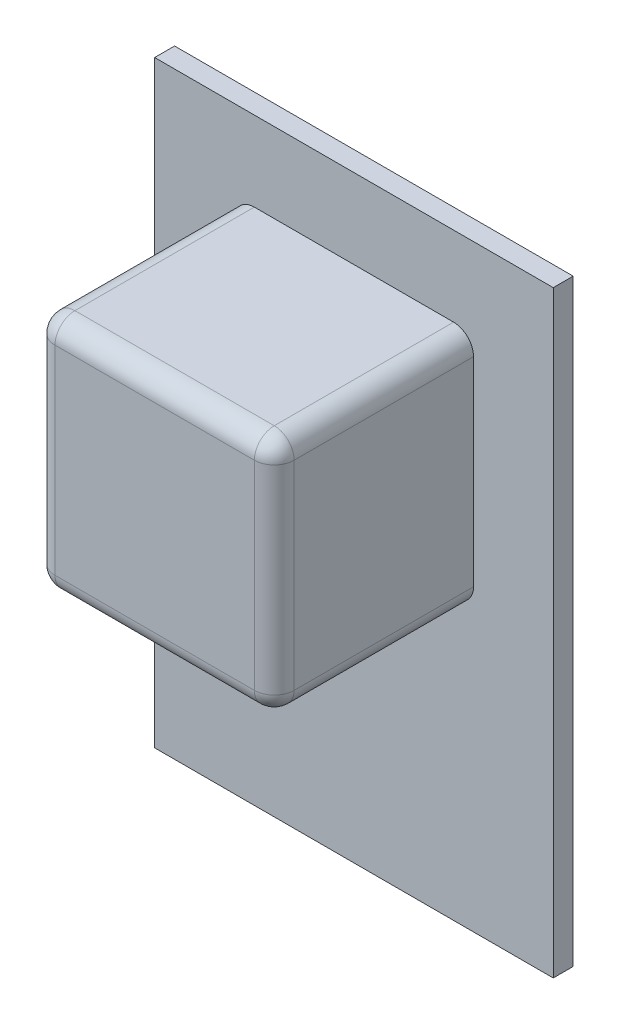
ISO-10303-21;
HEADER;
FILE_DESCRIPTION(('STEP AP214'),'2;1');
FILE_NAME('part.step','',(''),(''),'','','');
FILE_SCHEMA(('AUTOMOTIVE_DESIGN { 1 0 10303 214 1 1 1 1 }'));
ENDSEC;
DATA;
#1=APPLICATION_CONTEXT('core data for automotive mechanical design processes');
#2=APPLICATION_PROTOCOL_DEFINITION('international standard','automotive_design',2000,#1);
#3=PRODUCT_CONTEXT('',#1,'mechanical');
#4=PRODUCT('Part','Part','',(#3));
#5=PRODUCT_RELATED_PRODUCT_CATEGORY('part','',(#4));
#6=PRODUCT_DEFINITION_FORMATION('','',#4);
#7=PRODUCT_DEFINITION_CONTEXT('part definition',#1,'design');
#8=PRODUCT_DEFINITION('design','',#6,#7);
#9=PRODUCT_DEFINITION_SHAPE('','',#8);
#10=(LENGTH_UNIT() NAMED_UNIT(*) SI_UNIT(.MILLI.,.METRE.));
#11=(NAMED_UNIT(*) PLANE_ANGLE_UNIT() SI_UNIT($,.RADIAN.));
#12=(NAMED_UNIT(*) SI_UNIT($,.STERADIAN.) SOLID_ANGLE_UNIT());
#13=UNCERTAINTY_MEASURE_WITH_UNIT(LENGTH_MEASURE(1.E-05),#10,'distance_accuracy_value','');
#14=(GEOMETRIC_REPRESENTATION_CONTEXT(3) GLOBAL_UNCERTAINTY_ASSIGNED_CONTEXT((#13)) GLOBAL_UNIT_ASSIGNED_CONTEXT((#10,
#11,#12)) REPRESENTATION_CONTEXT('',''));
#15=CARTESIAN_POINT('',(0.,0.,0.));
#16=DIRECTION('',(0.,0.,1.));
#17=DIRECTION('',(1.,0.,0.));
#18=AXIS2_PLACEMENT_3D('',#15,#16,#17);
#19=CARTESIAN_POINT('',(0.,0.,0.));
#20=DIRECTION('',(0.,0.,-1.));
#21=DIRECTION('',(-1.,0.,0.));
#22=AXIS2_PLACEMENT_3D('',#19,#20,#21);
#23=PLANE('',#22);
#24=DIRECTION('',(0.,1.,0.));
#25=VECTOR('',#24,1.);
#26=CARTESIAN_POINT('',(100.,-150.,0.));
#27=LINE('',#26,#25);
#28=CARTESIAN_POINT('',(100.,-150.,0.));
#29=VERTEX_POINT('',#28);
#30=CARTESIAN_POINT('',(100.,150.,0.));
#31=VERTEX_POINT('',#30);
#32=EDGE_CURVE('E173',#29,#31,#27,.T.);
#33=ORIENTED_EDGE('',*,*,#32,.T.);
#34=DIRECTION('',(-1.,0.,0.));
#35=VECTOR('',#34,1.);
#36=CARTESIAN_POINT('',(-100.,150.,0.));
#37=LINE('',#36,#35);
#38=CARTESIAN_POINT('',(-100.,150.,0.));
#39=VERTEX_POINT('',#38);
#40=EDGE_CURVE('E142',#31,#39,#37,.T.);
#41=ORIENTED_EDGE('',*,*,#40,.T.);
#42=DIRECTION('',(0.,-1.,0.));
#43=VECTOR('',#42,1.);
#44=CARTESIAN_POINT('',(-100.,-150.,0.));
#45=LINE('',#44,#43);
#46=CARTESIAN_POINT('',(-100.,-150.,0.));
#47=VERTEX_POINT('',#46);
#48=EDGE_CURVE('E165',#39,#47,#45,.T.);
#49=ORIENTED_EDGE('',*,*,#48,.T.);
#50=DIRECTION('',(1.,0.,0.));
#51=VECTOR('',#50,1.);
#52=CARTESIAN_POINT('',(-100.,-150.,0.));
#53=LINE('',#52,#51);
#54=EDGE_CURVE('E162',#47,#29,#53,.T.);
#55=ORIENTED_EDGE('',*,*,#54,.T.);
#56=EDGE_LOOP('',(#33,#41,#49,#55));
#57=FACE_BOUND('',#56,.T.);
#58=DIRECTION('',(0.,1.,0.));
#59=VECTOR('',#58,1.);
#60=CARTESIAN_POINT('',(60.,-10.,0.));
#61=LINE('',#60,#59);
#62=CARTESIAN_POINT('',(60.,0.,0.));
#63=VERTEX_POINT('',#62);
#64=CARTESIAN_POINT('',(60.,100.,0.));
#65=VERTEX_POINT('',#64);
#66=EDGE_CURVE('E252',#63,#65,#61,.T.);
#67=ORIENTED_EDGE('',*,*,#66,.F.);
#68=CARTESIAN_POINT('',(50.,0.,0.));
#69=DIRECTION('',(0.,0.,-1.));
#70=DIRECTION('',(-1.,0.,0.));
#71=AXIS2_PLACEMENT_3D('',#68,#69,#70);
#72=CIRCLE('',#71,10.);
#73=CARTESIAN_POINT('',(50.,-10.,0.));
#74=VERTEX_POINT('',#73);
#75=EDGE_CURVE('E216',#63,#74,#72,.T.);
#76=ORIENTED_EDGE('',*,*,#75,.T.);
#77=DIRECTION('',(1.,0.,0.));
#78=VECTOR('',#77,1.);
#79=CARTESIAN_POINT('',(-60.,-10.,0.));
#80=LINE('',#79,#78);
#81=CARTESIAN_POINT('',(-50.,-10.,0.));
#82=VERTEX_POINT('',#81);
#83=EDGE_CURVE('E168',#82,#74,#80,.T.);
#84=ORIENTED_EDGE('',*,*,#83,.F.);
#85=CARTESIAN_POINT('',(-50.,0.,0.));
#86=DIRECTION('',(0.,0.,-1.));
#87=DIRECTION('',(-1.,0.,0.));
#88=AXIS2_PLACEMENT_3D('',#85,#86,#87);
#89=CIRCLE('',#88,10.);
#90=CARTESIAN_POINT('',(-60.,0.,0.));
#91=VERTEX_POINT('',#90);
#92=EDGE_CURVE('E214',#82,#91,#89,.T.);
#93=ORIENTED_EDGE('',*,*,#92,.T.);
#94=DIRECTION('',(0.,-1.,0.));
#95=VECTOR('',#94,1.);
#96=CARTESIAN_POINT('',(-60.,-10.,0.));
#97=LINE('',#96,#95);
#98=CARTESIAN_POINT('',(-60.,100.,0.));
#99=VERTEX_POINT('',#98);
#100=EDGE_CURVE('E258',#99,#91,#97,.T.);
#101=ORIENTED_EDGE('',*,*,#100,.F.);
#102=CARTESIAN_POINT('',(-50.,100.,0.));
#103=DIRECTION('',(0.,0.,-1.));
#104=DIRECTION('',(-1.,0.,0.));
#105=AXIS2_PLACEMENT_3D('',#102,#103,#104);
#106=CIRCLE('',#105,10.);
#107=CARTESIAN_POINT('',(-50.,110.,0.));
#108=VERTEX_POINT('',#107);
#109=EDGE_CURVE('E11',#99,#108,#106,.T.);
#110=ORIENTED_EDGE('',*,*,#109,.T.);
#111=DIRECTION('',(-1.,0.,0.));
#112=VECTOR('',#111,1.);
#113=CARTESIAN_POINT('',(-60.,110.,0.));
#114=LINE('',#113,#112);
#115=CARTESIAN_POINT('',(50.,110.,0.));
#116=VERTEX_POINT('',#115);
#117=EDGE_CURVE('E254',#116,#108,#114,.T.);
#118=ORIENTED_EDGE('',*,*,#117,.F.);
#119=CARTESIAN_POINT('',(50.,100.,0.));
#120=DIRECTION('',(0.,0.,-1.));
#121=DIRECTION('',(-1.,0.,0.));
#122=AXIS2_PLACEMENT_3D('',#119,#120,#121);
#123=CIRCLE('',#122,10.);
#124=EDGE_CURVE('E44',#116,#65,#123,.T.);
#125=ORIENTED_EDGE('',*,*,#124,.T.);
#126=EDGE_LOOP('',(#67,#76,#84,#93,#101,#110,#118,#125));
#127=FACE_BOUND('',#126,.T.);
#128=ADVANCED_FACE('F35',(#57,#127),#23,.F.);
#129=CARTESIAN_POINT('',(100.,-150.,-10.));
#130=DIRECTION('',(1.,0.,0.));
#131=DIRECTION('',(0.,0.,-1.));
#132=AXIS2_PLACEMENT_3D('',#129,#130,#131);
#133=PLANE('',#132);
#134=ORIENTED_EDGE('',*,*,#32,.F.);
#135=DIRECTION('',(0.,0.,1.));
#136=VECTOR('',#135,1.);
#137=CARTESIAN_POINT('',(100.,-150.,-10.));
#138=LINE('',#137,#136);
#139=CARTESIAN_POINT('',(100.,-150.,-10.));
#140=VERTEX_POINT('',#139);
#141=EDGE_CURVE('E161',#140,#29,#138,.T.);
#142=ORIENTED_EDGE('',*,*,#141,.F.);
#143=DIRECTION('',(0.,1.,0.));
#144=VECTOR('',#143,1.);
#145=CARTESIAN_POINT('',(100.,-150.,-10.));
#146=LINE('',#145,#144);
#147=CARTESIAN_POINT('',(100.,150.,-10.));
#148=VERTEX_POINT('',#147);
#149=EDGE_CURVE('E155',#140,#148,#146,.T.);
#150=ORIENTED_EDGE('',*,*,#149,.T.);
#151=DIRECTION('',(0.,0.,1.));
#152=VECTOR('',#151,1.);
#153=CARTESIAN_POINT('',(100.,150.,-10.));
#154=LINE('',#153,#152);
#155=EDGE_CURVE('E137',#148,#31,#154,.T.);
#156=ORIENTED_EDGE('',*,*,#155,.T.);
#157=EDGE_LOOP('',(#134,#142,#150,#156));
#158=FACE_BOUND('',#157,.T.);
#159=ADVANCED_FACE('F160',(#158),#133,.T.);
#160=CARTESIAN_POINT('',(-100.,-150.,-10.));
#161=DIRECTION('',(0.,-1.,0.));
#162=DIRECTION('',(0.,0.,-1.));
#163=AXIS2_PLACEMENT_3D('',#160,#161,#162);
#164=PLANE('',#163);
#165=ORIENTED_EDGE('',*,*,#54,.F.);
#166=DIRECTION('',(0.,0.,1.));
#167=VECTOR('',#166,1.);
#168=CARTESIAN_POINT('',(-100.,-150.,-10.));
#169=LINE('',#168,#167);
#170=CARTESIAN_POINT('',(-100.,-150.,-10.));
#171=VERTEX_POINT('',#170);
#172=EDGE_CURVE('E180',#171,#47,#169,.T.);
#173=ORIENTED_EDGE('',*,*,#172,.F.);
#174=DIRECTION('',(1.,0.,0.));
#175=VECTOR('',#174,1.);
#176=CARTESIAN_POINT('',(-100.,-150.,-10.));
#177=LINE('',#176,#175);
#178=EDGE_CURVE('E148',#171,#140,#177,.T.);
#179=ORIENTED_EDGE('',*,*,#178,.T.);
#180=ORIENTED_EDGE('',*,*,#141,.T.);
#181=EDGE_LOOP('',(#165,#173,#179,#180));
#182=FACE_BOUND('',#181,.T.);
#183=ADVANCED_FACE('F335',(#182),#164,.T.);
#184=CARTESIAN_POINT('',(-100.,-150.,-10.));
#185=DIRECTION('',(-1.,0.,0.));
#186=DIRECTION('',(0.,0.,1.));
#187=AXIS2_PLACEMENT_3D('',#184,#185,#186);
#188=PLANE('',#187);
#189=ORIENTED_EDGE('',*,*,#48,.F.);
#190=DIRECTION('',(0.,0.,1.));
#191=VECTOR('',#190,1.);
#192=CARTESIAN_POINT('',(-100.,150.,-10.));
#193=LINE('',#192,#191);
#194=CARTESIAN_POINT('',(-100.,150.,-10.));
#195=VERTEX_POINT('',#194);
#196=EDGE_CURVE('E147',#195,#39,#193,.T.);
#197=ORIENTED_EDGE('',*,*,#196,.F.);
#198=DIRECTION('',(0.,-1.,0.));
#199=VECTOR('',#198,1.);
#200=CARTESIAN_POINT('',(-100.,-150.,-10.));
#201=LINE('',#200,#199);
#202=EDGE_CURVE('E158',#195,#171,#201,.T.);
#203=ORIENTED_EDGE('',*,*,#202,.T.);
#204=ORIENTED_EDGE('',*,*,#172,.T.);
#205=EDGE_LOOP('',(#189,#197,#203,#204));
#206=FACE_BOUND('',#205,.T.);
#207=ADVANCED_FACE('F342',(#206),#188,.T.);
#208=CARTESIAN_POINT('',(-100.,150.,-10.));
#209=DIRECTION('',(0.,1.,0.));
#210=DIRECTION('',(0.,0.,1.));
#211=AXIS2_PLACEMENT_3D('',#208,#209,#210);
#212=PLANE('',#211);
#213=ORIENTED_EDGE('',*,*,#40,.F.);
#214=ORIENTED_EDGE('',*,*,#155,.F.);
#215=DIRECTION('',(-1.,0.,0.));
#216=VECTOR('',#215,1.);
#217=CARTESIAN_POINT('',(-100.,150.,-10.));
#218=LINE('',#217,#216);
#219=EDGE_CURVE('E140',#148,#195,#218,.T.);
#220=ORIENTED_EDGE('',*,*,#219,.T.);
#221=ORIENTED_EDGE('',*,*,#196,.T.);
#222=EDGE_LOOP('',(#213,#214,#220,#221));
#223=FACE_BOUND('',#222,.T.);
#224=ADVANCED_FACE('F139',(#223),#212,.T.);
#225=CARTESIAN_POINT('',(0.,0.,-10.));
#226=DIRECTION('',(0.,0.,-1.));
#227=DIRECTION('',(-1.,0.,0.));
#228=AXIS2_PLACEMENT_3D('',#225,#226,#227);
#229=PLANE('',#228);
#230=ORIENTED_EDGE('',*,*,#149,.F.);
#231=ORIENTED_EDGE('',*,*,#178,.F.);
#232=ORIENTED_EDGE('',*,*,#202,.F.);
#233=ORIENTED_EDGE('',*,*,#219,.F.);
#234=EDGE_LOOP('',(#230,#231,#232,#233));
#235=FACE_BOUND('',#234,.T.);
#236=ADVANCED_FACE('F153',(#235),#229,.T.);
#237=CARTESIAN_POINT('',(60.,-10.,100.));
#238=DIRECTION('',(-1.,0.,0.));
#239=DIRECTION('',(0.,0.,1.));
#240=AXIS2_PLACEMENT_3D('',#237,#238,#239);
#241=PLANE('',#240);
#242=DIRECTION('',(0.,1.,0.));
#243=VECTOR('',#242,1.);
#244=CARTESIAN_POINT('',(60.,-10.,90.));
#245=LINE('',#244,#243);
#246=CARTESIAN_POINT('',(60.,100.,90.));
#247=VERTEX_POINT('',#246);
#248=CARTESIAN_POINT('',(60.,0.,90.));
#249=VERTEX_POINT('',#248);
#250=EDGE_CURVE('E52',#247,#249,#245,.F.);
#251=ORIENTED_EDGE('',*,*,#250,.T.);
#252=DIRECTION('',(0.,0.,-1.));
#253=VECTOR('',#252,1.);
#254=CARTESIAN_POINT('',(60.,0.,100.));
#255=LINE('',#254,#253);
#256=EDGE_CURVE('E212',#249,#63,#255,.T.);
#257=ORIENTED_EDGE('',*,*,#256,.T.);
#258=ORIENTED_EDGE('',*,*,#66,.T.);
#259=DIRECTION('',(0.,0.,-1.));
#260=VECTOR('',#259,1.);
#261=CARTESIAN_POINT('',(60.,100.,100.));
#262=LINE('',#261,#260);
#263=EDGE_CURVE('E57',#65,#247,#262,.F.);
#264=ORIENTED_EDGE('',*,*,#263,.T.);
#265=EDGE_LOOP('',(#251,#257,#258,#264));
#266=FACE_BOUND('',#265,.T.);
#267=ADVANCED_FACE('F461',(#266),#241,.F.);
#268=CARTESIAN_POINT('',(-60.,110.,100.));
#269=DIRECTION('',(0.,-1.,0.));
#270=DIRECTION('',(1.,0.,0.));
#271=AXIS2_PLACEMENT_3D('',#268,#269,#270);
#272=PLANE('',#271);
#273=DIRECTION('',(-1.,0.,0.));
#274=VECTOR('',#273,1.);
#275=CARTESIAN_POINT('',(-60.,110.,90.));
#276=LINE('',#275,#274);
#277=CARTESIAN_POINT('',(-50.,110.,90.));
#278=VERTEX_POINT('',#277);
#279=CARTESIAN_POINT('',(50.,110.,90.));
#280=VERTEX_POINT('',#279);
#281=EDGE_CURVE('E206',#278,#280,#276,.F.);
#282=ORIENTED_EDGE('',*,*,#281,.T.);
#283=DIRECTION('',(0.,0.,-1.));
#284=VECTOR('',#283,1.);
#285=CARTESIAN_POINT('',(50.,110.,100.));
#286=LINE('',#285,#284);
#287=EDGE_CURVE('E208',#280,#116,#286,.T.);
#288=ORIENTED_EDGE('',*,*,#287,.T.);
#289=ORIENTED_EDGE('',*,*,#117,.T.);
#290=DIRECTION('',(0.,0.,-1.));
#291=VECTOR('',#290,1.);
#292=CARTESIAN_POINT('',(-50.,110.,100.));
#293=LINE('',#292,#291);
#294=EDGE_CURVE('E204',#108,#278,#293,.F.);
#295=ORIENTED_EDGE('',*,*,#294,.T.);
#296=EDGE_LOOP('',(#282,#288,#289,#295));
#297=FACE_BOUND('',#296,.T.);
#298=ADVANCED_FACE('F309',(#297),#272,.F.);
#299=CARTESIAN_POINT('',(-60.,-10.,100.));
#300=DIRECTION('',(1.,0.,0.));
#301=DIRECTION('',(0.,0.,-1.));
#302=AXIS2_PLACEMENT_3D('',#299,#300,#301);
#303=PLANE('',#302);
#304=ORIENTED_EDGE('',*,*,#100,.T.);
#305=DIRECTION('',(0.,0.,-1.));
#306=VECTOR('',#305,1.);
#307=CARTESIAN_POINT('',(-60.,0.,100.));
#308=LINE('',#307,#306);
#309=CARTESIAN_POINT('',(-60.,0.,90.));
#310=VERTEX_POINT('',#309);
#311=EDGE_CURVE('E202',#91,#310,#308,.F.);
#312=ORIENTED_EDGE('',*,*,#311,.T.);
#313=DIRECTION('',(0.,-1.,0.));
#314=VECTOR('',#313,1.);
#315=CARTESIAN_POINT('',(-60.,-10.,90.));
#316=LINE('',#315,#314);
#317=CARTESIAN_POINT('',(-60.,100.,90.));
#318=VERTEX_POINT('',#317);
#319=EDGE_CURVE('E200',#310,#318,#316,.F.);
#320=ORIENTED_EDGE('',*,*,#319,.T.);
#321=DIRECTION('',(0.,0.,-1.));
#322=VECTOR('',#321,1.);
#323=CARTESIAN_POINT('',(-60.,100.,100.));
#324=LINE('',#323,#322);
#325=EDGE_CURVE('E198',#318,#99,#324,.T.);
#326=ORIENTED_EDGE('',*,*,#325,.T.);
#327=EDGE_LOOP('',(#304,#312,#320,#326));
#328=FACE_BOUND('',#327,.T.);
#329=ADVANCED_FACE('F446',(#328),#303,.F.);
#330=CARTESIAN_POINT('',(-60.,-10.,100.));
#331=DIRECTION('',(0.,1.,0.));
#332=DIRECTION('',(0.,0.,1.));
#333=AXIS2_PLACEMENT_3D('',#330,#331,#332);
#334=PLANE('',#333);
#335=DIRECTION('',(1.,0.,0.));
#336=VECTOR('',#335,1.);
#337=CARTESIAN_POINT('',(-60.,-10.,90.));
#338=LINE('',#337,#336);
#339=CARTESIAN_POINT('',(50.,-10.,90.));
#340=VERTEX_POINT('',#339);
#341=CARTESIAN_POINT('',(-50.,-10.,90.));
#342=VERTEX_POINT('',#341);
#343=EDGE_CURVE('E193',#340,#342,#338,.F.);
#344=ORIENTED_EDGE('',*,*,#343,.T.);
#345=DIRECTION('',(0.,0.,-1.));
#346=VECTOR('',#345,1.);
#347=CARTESIAN_POINT('',(-50.,-10.,100.));
#348=LINE('',#347,#346);
#349=EDGE_CURVE('E196',#342,#82,#348,.T.);
#350=ORIENTED_EDGE('',*,*,#349,.T.);
#351=ORIENTED_EDGE('',*,*,#83,.T.);
#352=DIRECTION('',(0.,0.,-1.));
#353=VECTOR('',#352,1.);
#354=CARTESIAN_POINT('',(50.,-10.,100.));
#355=LINE('',#354,#353);
#356=EDGE_CURVE('E191',#74,#340,#355,.F.);
#357=ORIENTED_EDGE('',*,*,#356,.T.);
#358=EDGE_LOOP('',(#344,#350,#351,#357));
#359=FACE_BOUND('',#358,.T.);
#360=ADVANCED_FACE('F268',(#359),#334,.F.);
#361=CARTESIAN_POINT('',(0.,0.,100.));
#362=DIRECTION('',(0.,0.,-1.));
#363=DIRECTION('',(-1.,0.,0.));
#364=AXIS2_PLACEMENT_3D('',#361,#362,#363);
#365=PLANE('',#364);
#366=DIRECTION('',(0.,-1.,0.));
#367=VECTOR('',#366,1.);
#368=CARTESIAN_POINT('',(-50.,0.,100.));
#369=LINE('',#368,#367);
#370=CARTESIAN_POINT('',(-50.,100.,100.));
#371=VERTEX_POINT('',#370);
#372=CARTESIAN_POINT('',(-50.,0.,100.));
#373=VERTEX_POINT('',#372);
#374=EDGE_CURVE('E186',#371,#373,#369,.T.);
#375=ORIENTED_EDGE('',*,*,#374,.T.);
#376=DIRECTION('',(1.,0.,0.));
#377=VECTOR('',#376,1.);
#378=CARTESIAN_POINT('',(0.,0.,100.));
#379=LINE('',#378,#377);
#380=CARTESIAN_POINT('',(50.,0.,100.));
#381=VERTEX_POINT('',#380);
#382=EDGE_CURVE('E188',#373,#381,#379,.T.);
#383=ORIENTED_EDGE('',*,*,#382,.T.);
#384=DIRECTION('',(0.,1.,0.));
#385=VECTOR('',#384,1.);
#386=CARTESIAN_POINT('',(50.,0.,100.));
#387=LINE('',#386,#385);
#388=CARTESIAN_POINT('',(50.,100.,100.));
#389=VERTEX_POINT('',#388);
#390=EDGE_CURVE('E179',#381,#389,#387,.T.);
#391=ORIENTED_EDGE('',*,*,#390,.T.);
#392=DIRECTION('',(-1.,0.,0.));
#393=VECTOR('',#392,1.);
#394=CARTESIAN_POINT('',(0.,100.,100.));
#395=LINE('',#394,#393);
#396=EDGE_CURVE('E184',#389,#371,#395,.T.);
#397=ORIENTED_EDGE('',*,*,#396,.T.);
#398=EDGE_LOOP('',(#375,#383,#391,#397));
#399=FACE_BOUND('',#398,.T.);
#400=ADVANCED_FACE('F291',(#399),#365,.F.);
#401=CARTESIAN_POINT('',(-50.,100.,100.));
#402=DIRECTION('',(0.,0.,-1.));
#403=DIRECTION('',(-1.,0.,0.));
#404=AXIS2_PLACEMENT_3D('',#401,#402,#403);
#405=CYLINDRICAL_SURFACE('',#404,10.);
#406=ORIENTED_EDGE('',*,*,#109,.F.);
#407=ORIENTED_EDGE('',*,*,#325,.F.);
#408=CARTESIAN_POINT('',(-50.,100.,90.));
#409=DIRECTION('',(0.,0.,1.));
#410=DIRECTION('',(1.,0.,0.));
#411=AXIS2_PLACEMENT_3D('',#408,#409,#410);
#412=CIRCLE('',#411,10.);
#413=EDGE_CURVE('E39',#278,#318,#412,.T.);
#414=ORIENTED_EDGE('',*,*,#413,.F.);
#415=ORIENTED_EDGE('',*,*,#294,.F.);
#416=EDGE_LOOP('',(#406,#407,#414,#415));
#417=FACE_BOUND('',#416,.T.);
#418=ADVANCED_FACE('F37',(#417),#405,.T.);
#419=CARTESIAN_POINT('',(0.,100.,90.));
#420=DIRECTION('',(-1.,0.,0.));
#421=DIRECTION('',(0.,-1.,0.));
#422=AXIS2_PLACEMENT_3D('',#419,#420,#421);
#423=CYLINDRICAL_SURFACE('',#422,10.);
#424=CARTESIAN_POINT('',(50.,100.,90.));
#425=DIRECTION('',(1.,0.,0.));
#426=DIRECTION('',(0.,0.,-1.));
#427=AXIS2_PLACEMENT_3D('',#424,#425,#426);
#428=CIRCLE('',#427,10.);
#429=EDGE_CURVE('E244',#280,#389,#428,.T.);
#430=ORIENTED_EDGE('',*,*,#429,.F.);
#431=ORIENTED_EDGE('',*,*,#281,.F.);
#432=CARTESIAN_POINT('',(-50.,100.,90.));
#433=DIRECTION('',(-1.,0.,0.));
#434=DIRECTION('',(0.,0.,1.));
#435=AXIS2_PLACEMENT_3D('',#432,#433,#434);
#436=CIRCLE('',#435,10.);
#437=EDGE_CURVE('E246',#371,#278,#436,.T.);
#438=ORIENTED_EDGE('',*,*,#437,.F.);
#439=ORIENTED_EDGE('',*,*,#396,.F.);
#440=EDGE_LOOP('',(#430,#431,#438,#439));
#441=FACE_BOUND('',#440,.T.);
#442=ADVANCED_FACE('F313',(#441),#423,.T.);
#443=CARTESIAN_POINT('',(50.,100.,100.));
#444=DIRECTION('',(0.,0.,-1.));
#445=DIRECTION('',(-1.,0.,0.));
#446=AXIS2_PLACEMENT_3D('',#443,#444,#445);
#447=CYLINDRICAL_SURFACE('',#446,10.);
#448=ORIENTED_EDGE('',*,*,#124,.F.);
#449=ORIENTED_EDGE('',*,*,#287,.F.);
#450=CARTESIAN_POINT('',(50.,100.,90.));
#451=DIRECTION('',(0.,0.,1.));
#452=DIRECTION('',(1.,0.,0.));
#453=AXIS2_PLACEMENT_3D('',#450,#451,#452);
#454=CIRCLE('',#453,10.);
#455=EDGE_CURVE('E241',#247,#280,#454,.T.);
#456=ORIENTED_EDGE('',*,*,#455,.F.);
#457=ORIENTED_EDGE('',*,*,#263,.F.);
#458=EDGE_LOOP('',(#448,#449,#456,#457));
#459=FACE_BOUND('',#458,.T.);
#460=ADVANCED_FACE('F318',(#459),#447,.T.);
#461=CARTESIAN_POINT('',(-50.,100.,90.));
#462=DIRECTION('',(0.,0.,1.));
#463=DIRECTION('',(1.,0.,0.));
#464=AXIS2_PLACEMENT_3D('',#461,#462,#463);
#465=SPHERICAL_SURFACE('',#464,10.);
#466=ORIENTED_EDGE('',*,*,#437,.T.);
#467=ORIENTED_EDGE('',*,*,#413,.T.);
#468=CARTESIAN_POINT('',(-50.,100.,90.));
#469=DIRECTION('',(0.,1.,0.));
#470=DIRECTION('',(0.,0.,1.));
#471=AXIS2_PLACEMENT_3D('',#468,#469,#470);
#472=CIRCLE('',#471,10.);
#473=EDGE_CURVE('E238',#371,#318,#472,.F.);
#474=ORIENTED_EDGE('',*,*,#473,.F.);
#475=EDGE_LOOP('',(#466,#467,#474));
#476=FACE_BOUND('',#475,.T.);
#477=ADVANCED_FACE('F320',(#476),#465,.T.);
#478=CARTESIAN_POINT('',(50.,100.,90.));
#479=DIRECTION('',(0.,0.,1.));
#480=DIRECTION('',(1.,0.,0.));
#481=AXIS2_PLACEMENT_3D('',#478,#479,#480);
#482=SPHERICAL_SURFACE('',#481,10.);
#483=ORIENTED_EDGE('',*,*,#455,.T.);
#484=ORIENTED_EDGE('',*,*,#429,.T.);
#485=CARTESIAN_POINT('',(50.,100.,90.));
#486=DIRECTION('',(0.,1.,0.));
#487=DIRECTION('',(-1.,0.,0.));
#488=AXIS2_PLACEMENT_3D('',#485,#486,#487);
#489=CIRCLE('',#488,10.);
#490=EDGE_CURVE('E235',#247,#389,#489,.F.);
#491=ORIENTED_EDGE('',*,*,#490,.F.);
#492=EDGE_LOOP('',(#483,#484,#491));
#493=FACE_BOUND('',#492,.T.);
#494=ADVANCED_FACE('F315',(#493),#482,.T.);
#495=CARTESIAN_POINT('',(-50.,0.,100.));
#496=DIRECTION('',(0.,0.,-1.));
#497=DIRECTION('',(-1.,0.,0.));
#498=AXIS2_PLACEMENT_3D('',#495,#496,#497);
#499=CYLINDRICAL_SURFACE('',#498,10.);
#500=ORIENTED_EDGE('',*,*,#92,.F.);
#501=ORIENTED_EDGE('',*,*,#349,.F.);
#502=CARTESIAN_POINT('',(-50.,0.,90.));
#503=DIRECTION('',(0.,0.,1.));
#504=DIRECTION('',(1.,0.,0.));
#505=AXIS2_PLACEMENT_3D('',#502,#503,#504);
#506=CIRCLE('',#505,10.);
#507=EDGE_CURVE('E232',#310,#342,#506,.T.);
#508=ORIENTED_EDGE('',*,*,#507,.F.);
#509=ORIENTED_EDGE('',*,*,#311,.F.);
#510=EDGE_LOOP('',(#500,#501,#508,#509));
#511=FACE_BOUND('',#510,.T.);
#512=ADVANCED_FACE('F301',(#511),#499,.T.);
#513=CARTESIAN_POINT('',(-50.,0.,90.));
#514=DIRECTION('',(0.,-1.,0.));
#515=DIRECTION('',(0.,0.,-1.));
#516=AXIS2_PLACEMENT_3D('',#513,#514,#515);
#517=CYLINDRICAL_SURFACE('',#516,10.);
#518=ORIENTED_EDGE('',*,*,#473,.T.);
#519=ORIENTED_EDGE('',*,*,#319,.F.);
#520=CARTESIAN_POINT('',(-50.,0.,90.));
#521=DIRECTION('',(0.,-1.,0.));
#522=DIRECTION('',(0.,0.,-1.));
#523=AXIS2_PLACEMENT_3D('',#520,#521,#522);
#524=CIRCLE('',#523,10.);
#525=EDGE_CURVE('E229',#373,#310,#524,.T.);
#526=ORIENTED_EDGE('',*,*,#525,.F.);
#527=ORIENTED_EDGE('',*,*,#374,.F.);
#528=EDGE_LOOP('',(#518,#519,#526,#527));
#529=FACE_BOUND('',#528,.T.);
#530=ADVANCED_FACE('F296',(#529),#517,.T.);
#531=CARTESIAN_POINT('',(50.,0.,90.));
#532=DIRECTION('',(0.,1.,0.));
#533=DIRECTION('',(0.,0.,1.));
#534=AXIS2_PLACEMENT_3D('',#531,#532,#533);
#535=CYLINDRICAL_SURFACE('',#534,10.);
#536=ORIENTED_EDGE('',*,*,#490,.T.);
#537=ORIENTED_EDGE('',*,*,#390,.F.);
#538=CARTESIAN_POINT('',(50.,0.,90.));
#539=DIRECTION('',(0.,-1.,0.));
#540=DIRECTION('',(0.,0.,-1.));
#541=AXIS2_PLACEMENT_3D('',#538,#539,#540);
#542=CIRCLE('',#541,10.);
#543=EDGE_CURVE('E226',#249,#381,#542,.T.);
#544=ORIENTED_EDGE('',*,*,#543,.F.);
#545=ORIENTED_EDGE('',*,*,#250,.F.);
#546=EDGE_LOOP('',(#536,#537,#544,#545));
#547=FACE_BOUND('',#546,.T.);
#548=ADVANCED_FACE('F287',(#547),#535,.T.);
#549=CARTESIAN_POINT('',(50.,0.,100.));
#550=DIRECTION('',(0.,0.,-1.));
#551=DIRECTION('',(-1.,0.,0.));
#552=AXIS2_PLACEMENT_3D('',#549,#550,#551);
#553=CYLINDRICAL_SURFACE('',#552,10.);
#554=ORIENTED_EDGE('',*,*,#75,.F.);
#555=ORIENTED_EDGE('',*,*,#256,.F.);
#556=CARTESIAN_POINT('',(50.,0.,90.));
#557=DIRECTION('',(0.,0.,1.));
#558=DIRECTION('',(1.,0.,0.));
#559=AXIS2_PLACEMENT_3D('',#556,#557,#558);
#560=CIRCLE('',#559,10.);
#561=EDGE_CURVE('E223',#340,#249,#560,.T.);
#562=ORIENTED_EDGE('',*,*,#561,.F.);
#563=ORIENTED_EDGE('',*,*,#356,.F.);
#564=EDGE_LOOP('',(#554,#555,#562,#563));
#565=FACE_BOUND('',#564,.T.);
#566=ADVANCED_FACE('F275',(#565),#553,.T.);
#567=CARTESIAN_POINT('',(-50.,0.,90.));
#568=DIRECTION('',(0.,0.,1.));
#569=DIRECTION('',(1.,0.,0.));
#570=AXIS2_PLACEMENT_3D('',#567,#568,#569);
#571=SPHERICAL_SURFACE('',#570,10.);
#572=ORIENTED_EDGE('',*,*,#525,.T.);
#573=ORIENTED_EDGE('',*,*,#507,.T.);
#574=CARTESIAN_POINT('',(-50.,0.,90.));
#575=DIRECTION('',(-1.,0.,0.));
#576=DIRECTION('',(0.,0.,1.));
#577=AXIS2_PLACEMENT_3D('',#574,#575,#576);
#578=CIRCLE('',#577,10.);
#579=EDGE_CURVE('E221',#373,#342,#578,.F.);
#580=ORIENTED_EDGE('',*,*,#579,.F.);
#581=EDGE_LOOP('',(#572,#573,#580));
#582=FACE_BOUND('',#581,.T.);
#583=ADVANCED_FACE('F299',(#582),#571,.T.);
#584=CARTESIAN_POINT('',(50.,0.,90.));
#585=DIRECTION('',(0.,0.,1.));
#586=DIRECTION('',(1.,0.,0.));
#587=AXIS2_PLACEMENT_3D('',#584,#585,#586);
#588=SPHERICAL_SURFACE('',#587,10.);
#589=ORIENTED_EDGE('',*,*,#561,.T.);
#590=ORIENTED_EDGE('',*,*,#543,.T.);
#591=CARTESIAN_POINT('',(50.,0.,90.));
#592=DIRECTION('',(1.,0.,0.));
#593=DIRECTION('',(0.,0.,-1.));
#594=AXIS2_PLACEMENT_3D('',#591,#592,#593);
#595=CIRCLE('',#594,10.);
#596=EDGE_CURVE('E219',#340,#381,#595,.F.);
#597=ORIENTED_EDGE('',*,*,#596,.F.);
#598=EDGE_LOOP('',(#589,#590,#597));
#599=FACE_BOUND('',#598,.T.);
#600=ADVANCED_FACE('F284',(#599),#588,.T.);
#601=CARTESIAN_POINT('',(0.,0.,90.));
#602=DIRECTION('',(1.,0.,0.));
#603=DIRECTION('',(0.,0.,-1.));
#604=AXIS2_PLACEMENT_3D('',#601,#602,#603);
#605=CYLINDRICAL_SURFACE('',#604,10.);
#606=ORIENTED_EDGE('',*,*,#579,.T.);
#607=ORIENTED_EDGE('',*,*,#343,.F.);
#608=ORIENTED_EDGE('',*,*,#596,.T.);
#609=ORIENTED_EDGE('',*,*,#382,.F.);
#610=EDGE_LOOP('',(#606,#607,#608,#609));
#611=FACE_BOUND('',#610,.T.);
#612=ADVANCED_FACE('F281',(#611),#605,.T.);
#613=CLOSED_SHELL('',(#128,#159,#183,#207,#224,#236,#267,#298,#329,#360,#400,#418,#442,#460,
#477,#494,#512,#530,#548,#566,#583,#600,#612));
#614=MANIFOLD_SOLID_BREP('B2',#613);
#615=ADVANCED_BREP_SHAPE_REPRESENTATION('',(#18,#614),#14);
#616=SHAPE_DEFINITION_REPRESENTATION(#9,#615);
ENDSEC;
END-ISO-10303-21;
